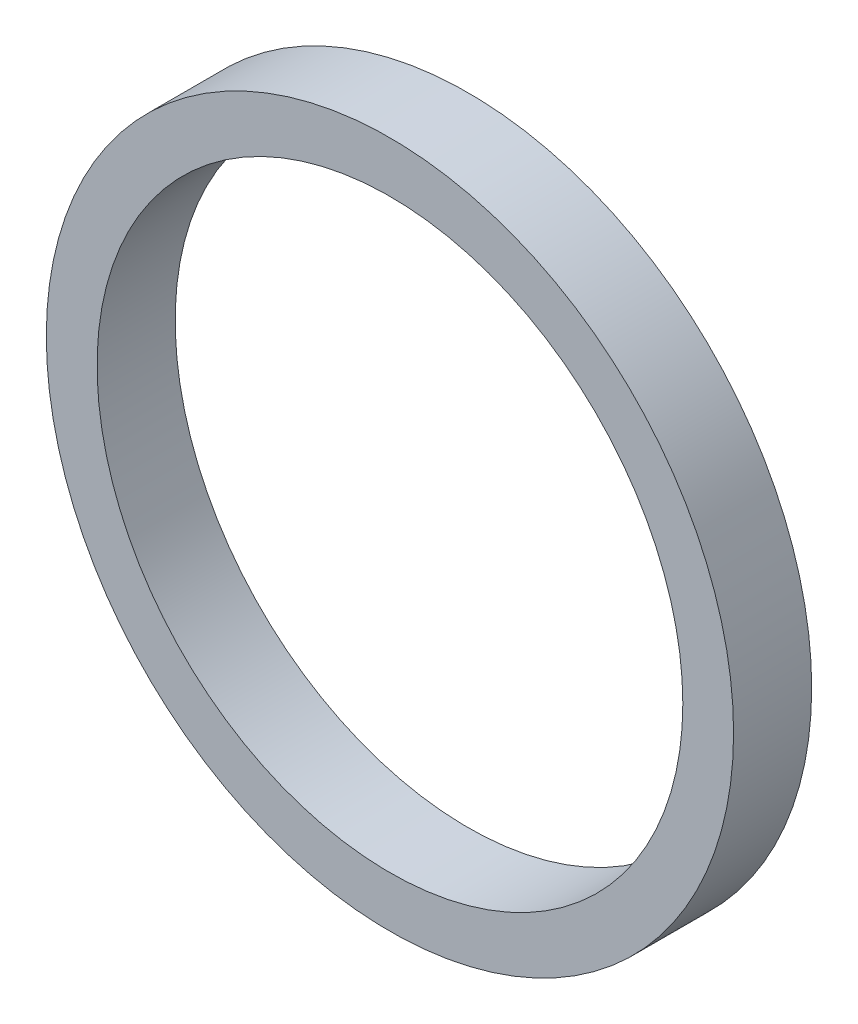
ISO-10303-21;
HEADER;
FILE_DESCRIPTION(('STEP AP214'),'2;1');
FILE_NAME('part.step','',(''),(''),'','','');
FILE_SCHEMA(('AUTOMOTIVE_DESIGN { 1 0 10303 214 1 1 1 1 }'));
ENDSEC;
DATA;
#1=APPLICATION_CONTEXT('core data for automotive mechanical design processes');
#2=APPLICATION_PROTOCOL_DEFINITION('international standard','automotive_design',2000,#1);
#3=PRODUCT_CONTEXT('',#1,'mechanical');
#4=PRODUCT('Part','Part','',(#3));
#5=PRODUCT_RELATED_PRODUCT_CATEGORY('part','',(#4));
#6=PRODUCT_DEFINITION_FORMATION('','',#4);
#7=PRODUCT_DEFINITION_CONTEXT('part definition',#1,'design');
#8=PRODUCT_DEFINITION('design','',#6,#7);
#9=PRODUCT_DEFINITION_SHAPE('','',#8);
#10=(LENGTH_UNIT() NAMED_UNIT(*) SI_UNIT(.MILLI.,.METRE.));
#11=(NAMED_UNIT(*) PLANE_ANGLE_UNIT() SI_UNIT($,.RADIAN.));
#12=(NAMED_UNIT(*) SI_UNIT($,.STERADIAN.) SOLID_ANGLE_UNIT());
#13=UNCERTAINTY_MEASURE_WITH_UNIT(LENGTH_MEASURE(1.E-05),#10,'distance_accuracy_value','');
#14=(GEOMETRIC_REPRESENTATION_CONTEXT(3) GLOBAL_UNCERTAINTY_ASSIGNED_CONTEXT((#13)) GLOBAL_UNIT_ASSIGNED_CONTEXT((#10,
#11,#12)) REPRESENTATION_CONTEXT('',''));
#15=CARTESIAN_POINT('',(0.,0.,0.));
#16=DIRECTION('',(0.,0.,1.));
#17=DIRECTION('',(1.,0.,0.));
#18=AXIS2_PLACEMENT_3D('',#15,#16,#17);
#19=CARTESIAN_POINT('',(0.,0.,0.));
#20=DIRECTION('',(0.,0.,1.));
#21=DIRECTION('',(1.,0.,0.));
#22=AXIS2_PLACEMENT_3D('',#19,#20,#21);
#23=PLANE('',#22);
#24=CARTESIAN_POINT('',(0.,0.,0.));
#25=DIRECTION('',(0.,0.,1.));
#26=DIRECTION('',(1.,0.,0.));
#27=AXIS2_PLACEMENT_3D('',#24,#25,#26);
#28=CIRCLE('',#27,19.05);
#29=CARTESIAN_POINT('',(19.05,0.,0.));
#30=VERTEX_POINT('',#29);
#31=EDGE_CURVE('E38',#30,#30,#28,.T.);
#32=ORIENTED_EDGE('',*,*,#31,.T.);
#33=EDGE_LOOP('',(#32));
#34=FACE_BOUND('',#33,.T.);
#35=CARTESIAN_POINT('',(0.,0.,0.));
#36=DIRECTION('',(0.,0.,-1.));
#37=DIRECTION('',(-1.,0.,0.));
#38=AXIS2_PLACEMENT_3D('',#35,#36,#37);
#39=CIRCLE('',#38,22.352);
#40=CARTESIAN_POINT('',(-22.352,0.,0.));
#41=VERTEX_POINT('',#40);
#42=EDGE_CURVE('E31',#41,#41,#39,.F.);
#43=ORIENTED_EDGE('',*,*,#42,.F.);
#44=EDGE_LOOP('',(#43));
#45=FACE_BOUND('',#44,.T.);
#46=ADVANCED_FACE('F28',(#34,#45),#23,.F.);
#47=CARTESIAN_POINT('',(0.,0.,5.08));
#48=DIRECTION('',(0.,0.,-1.));
#49=DIRECTION('',(-1.,0.,0.));
#50=AXIS2_PLACEMENT_3D('',#47,#48,#49);
#51=CYLINDRICAL_SURFACE('',#50,22.352);
#52=ORIENTED_EDGE('',*,*,#42,.T.);
#53=EDGE_LOOP('',(#52));
#54=FACE_BOUND('',#53,.T.);
#55=CARTESIAN_POINT('',(0.,0.,5.08));
#56=DIRECTION('',(0.,0.,-1.));
#57=DIRECTION('',(-1.,0.,0.));
#58=AXIS2_PLACEMENT_3D('',#55,#56,#57);
#59=CIRCLE('',#58,22.352);
#60=CARTESIAN_POINT('',(-22.352,0.,5.08));
#61=VERTEX_POINT('',#60);
#62=EDGE_CURVE('E10',#61,#61,#59,.F.);
#63=ORIENTED_EDGE('',*,*,#62,.F.);
#64=EDGE_LOOP('',(#63));
#65=FACE_BOUND('',#64,.T.);
#66=ADVANCED_FACE('F56',(#54,#65),#51,.T.);
#67=CARTESIAN_POINT('',(0.,0.,5.08));
#68=DIRECTION('',(0.,0.,1.));
#69=DIRECTION('',(1.,0.,0.));
#70=AXIS2_PLACEMENT_3D('',#67,#68,#69);
#71=PLANE('',#70);
#72=CARTESIAN_POINT('',(0.,0.,5.08));
#73=DIRECTION('',(0.,0.,1.));
#74=DIRECTION('',(1.,0.,0.));
#75=AXIS2_PLACEMENT_3D('',#72,#73,#74);
#76=CIRCLE('',#75,19.05);
#77=CARTESIAN_POINT('',(19.05,0.,5.08));
#78=VERTEX_POINT('',#77);
#79=EDGE_CURVE('E40',#78,#78,#76,.T.);
#80=ORIENTED_EDGE('',*,*,#79,.F.);
#81=EDGE_LOOP('',(#80));
#82=FACE_BOUND('',#81,.T.);
#83=ORIENTED_EDGE('',*,*,#62,.T.);
#84=EDGE_LOOP('',(#83));
#85=FACE_BOUND('',#84,.T.);
#86=ADVANCED_FACE('F51',(#82,#85),#71,.T.);
#87=CARTESIAN_POINT('',(0.,0.,0.));
#88=DIRECTION('',(0.,0.,1.));
#89=DIRECTION('',(1.,0.,0.));
#90=AXIS2_PLACEMENT_3D('',#87,#88,#89);
#91=CYLINDRICAL_SURFACE('',#90,19.05);
#92=ORIENTED_EDGE('',*,*,#31,.F.);
#93=EDGE_LOOP('',(#92));
#94=FACE_BOUND('',#93,.T.);
#95=ORIENTED_EDGE('',*,*,#79,.T.);
#96=EDGE_LOOP('',(#95));
#97=FACE_BOUND('',#96,.T.);
#98=ADVANCED_FACE('F48',(#94,#97),#91,.F.);
#99=CLOSED_SHELL('',(#46,#66,#86,#98));
#100=MANIFOLD_SOLID_BREP('B2',#99);
#101=ADVANCED_BREP_SHAPE_REPRESENTATION('',(#18,#100),#14);
#102=SHAPE_DEFINITION_REPRESENTATION(#9,#101);
ENDSEC;
END-ISO-10303-21;
